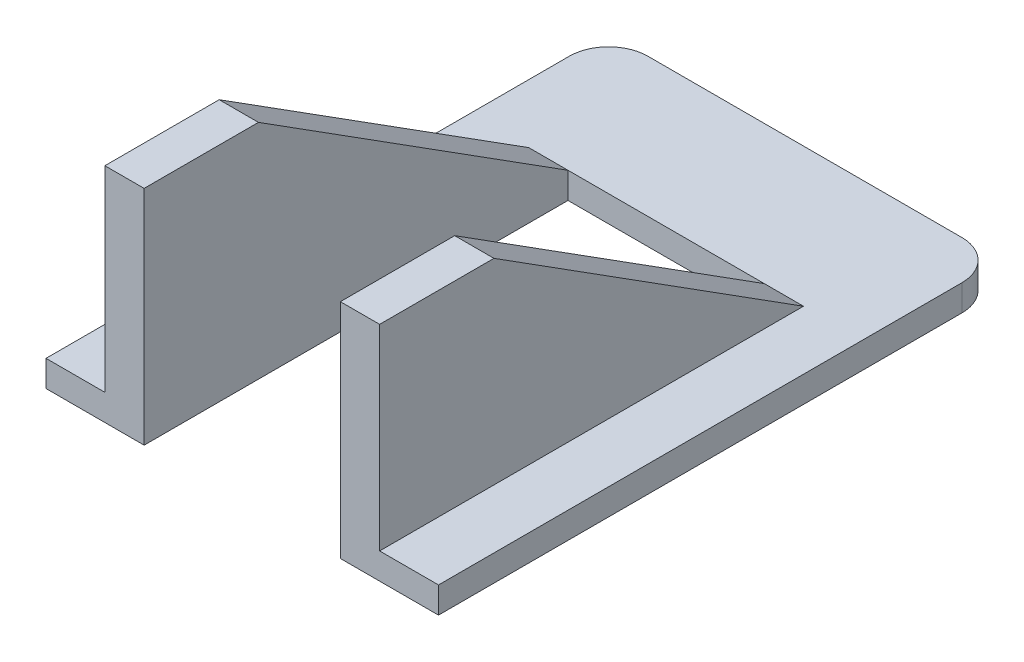
ISO-10303-21;
HEADER;
FILE_DESCRIPTION(('STEP AP214'),'2;1');
FILE_NAME('part.step','',(''),(''),'','','');
FILE_SCHEMA(('AUTOMOTIVE_DESIGN { 1 0 10303 214 1 1 1 1 }'));
ENDSEC;
DATA;
#1=APPLICATION_CONTEXT('core data for automotive mechanical design processes');
#2=APPLICATION_PROTOCOL_DEFINITION('international standard','automotive_design',2000,#1);
#3=PRODUCT_CONTEXT('',#1,'mechanical');
#4=PRODUCT('Part','Part','',(#3));
#5=PRODUCT_RELATED_PRODUCT_CATEGORY('part','',(#4));
#6=PRODUCT_DEFINITION_FORMATION('','',#4);
#7=PRODUCT_DEFINITION_CONTEXT('part definition',#1,'design');
#8=PRODUCT_DEFINITION('design','',#6,#7);
#9=PRODUCT_DEFINITION_SHAPE('','',#8);
#10=(LENGTH_UNIT() NAMED_UNIT(*) SI_UNIT(.MILLI.,.METRE.));
#11=(NAMED_UNIT(*) PLANE_ANGLE_UNIT() SI_UNIT($,.RADIAN.));
#12=(NAMED_UNIT(*) SI_UNIT($,.STERADIAN.) SOLID_ANGLE_UNIT());
#13=UNCERTAINTY_MEASURE_WITH_UNIT(LENGTH_MEASURE(1.E-05),#10,'distance_accuracy_value','');
#14=(GEOMETRIC_REPRESENTATION_CONTEXT(3) GLOBAL_UNCERTAINTY_ASSIGNED_CONTEXT((#13)) GLOBAL_UNIT_ASSIGNED_CONTEXT((#10,
#11,#12)) REPRESENTATION_CONTEXT('',''));
#15=CARTESIAN_POINT('',(0.,0.,0.));
#16=DIRECTION('',(0.,0.,1.));
#17=DIRECTION('',(1.,0.,0.));
#18=AXIS2_PLACEMENT_3D('',#15,#16,#17);
#19=CARTESIAN_POINT('',(30.,1.47718631178707,41.2832699619772));
#20=DIRECTION('',(0.,0.,-1.));
#21=DIRECTION('',(0.,1.,0.));
#22=AXIS2_PLACEMENT_3D('',#19,#20,#21);
#23=PLANE('',#22);
#24=DIRECTION('',(0.,-1.,0.));
#25=VECTOR('',#24,1.);
#26=CARTESIAN_POINT('',(25.5,1.47718631178707,41.2832699619772));
#27=LINE('',#26,#25);
#28=CARTESIAN_POINT('',(25.5,-1.52281368821293,41.2832699619772));
#29=VERTEX_POINT('',#28);
#30=CARTESIAN_POINT('',(25.5,-16.5228136882129,41.2832699619772));
#31=VERTEX_POINT('',#30);
#32=EDGE_CURVE('E166',#29,#31,#27,.T.);
#33=ORIENTED_EDGE('',*,*,#32,.F.);
#34=DIRECTION('',(1.,0.,0.));
#35=VECTOR('',#34,1.);
#36=CARTESIAN_POINT('',(3.,-1.52281368821293,41.2832699619772));
#37=LINE('',#36,#35);
#38=CARTESIAN_POINT('',(22.5,-1.52281368821293,41.2832699619772));
#39=VERTEX_POINT('',#38);
#40=EDGE_CURVE('E148',#39,#29,#37,.T.);
#41=ORIENTED_EDGE('',*,*,#40,.F.);
#42=DIRECTION('',(0.,-1.,0.));
#43=VECTOR('',#42,1.);
#44=CARTESIAN_POINT('',(22.5,-16.5228136882129,41.2832699619772));
#45=LINE('',#44,#43);
#46=CARTESIAN_POINT('',(22.5,-18.5228136882129,41.2832699619772));
#47=VERTEX_POINT('',#46);
#48=EDGE_CURVE('E189',#39,#47,#45,.T.);
#49=ORIENTED_EDGE('',*,*,#48,.T.);
#50=DIRECTION('',(-1.,0.,0.));
#51=VECTOR('',#50,1.);
#52=CARTESIAN_POINT('',(30.,-18.5228136882129,41.2832699619772));
#53=LINE('',#52,#51);
#54=CARTESIAN_POINT('',(30.,-18.5228136882129,41.2832699619772));
#55=VERTEX_POINT('',#54);
#56=EDGE_CURVE('E279',#55,#47,#53,.T.);
#57=ORIENTED_EDGE('',*,*,#56,.F.);
#58=DIRECTION('',(0.,-1.,0.));
#59=VECTOR('',#58,1.);
#60=CARTESIAN_POINT('',(30.,1.47718631178707,41.2832699619772));
#61=LINE('',#60,#59);
#62=CARTESIAN_POINT('',(30.,-16.5228136882129,41.2832699619772));
#63=VERTEX_POINT('',#62);
#64=EDGE_CURVE('E230',#63,#55,#61,.T.);
#65=ORIENTED_EDGE('',*,*,#64,.F.);
#66=DIRECTION('',(1.,0.,0.));
#67=VECTOR('',#66,1.);
#68=CARTESIAN_POINT('',(25.5,-16.5228136882129,41.2832699619772));
#69=LINE('',#68,#67);
#70=EDGE_CURVE('E174',#31,#63,#69,.T.);
#71=ORIENTED_EDGE('',*,*,#70,.F.);
#72=EDGE_LOOP('',(#33,#41,#49,#57,#65,#71));
#73=FACE_BOUND('',#72,.T.);
#74=ADVANCED_FACE('F40',(#73),#23,.F.);
#75=DIRECTION('',(0.,1.,0.));
#76=VECTOR('',#75,1.);
#77=CARTESIAN_POINT('',(7.5,-16.5228136882129,41.2832699619772));
#78=LINE('',#77,#76);
#79=CARTESIAN_POINT('',(7.5,-18.5228136882129,41.2832699619772));
#80=VERTEX_POINT('',#79);
#81=CARTESIAN_POINT('',(7.5,-1.52281368821293,41.2832699619772));
#82=VERTEX_POINT('',#81);
#83=EDGE_CURVE('E198',#80,#82,#78,.T.);
#84=ORIENTED_EDGE('',*,*,#83,.T.);
#85=CARTESIAN_POINT('',(4.5,-1.52281368821293,41.2832699619772));
#86=VERTEX_POINT('',#85);
#87=EDGE_CURVE('E160',#86,#82,#37,.T.);
#88=ORIENTED_EDGE('',*,*,#87,.F.);
#89=DIRECTION('',(0.,1.,0.));
#90=VECTOR('',#89,1.);
#91=CARTESIAN_POINT('',(4.5,-16.5228136882129,41.2832699619772));
#92=LINE('',#91,#90);
#93=CARTESIAN_POINT('',(4.5,-16.5228136882129,41.2832699619772));
#94=VERTEX_POINT('',#93);
#95=EDGE_CURVE('E305',#94,#86,#92,.T.);
#96=ORIENTED_EDGE('',*,*,#95,.F.);
#97=DIRECTION('',(-1.,0.,0.));
#98=VECTOR('',#97,1.);
#99=CARTESIAN_POINT('',(4.5,-16.5228136882129,41.2832699619772));
#100=LINE('',#99,#98);
#101=CARTESIAN_POINT('',(0.,-16.5228136882129,41.2832699619772));
#102=VERTEX_POINT('',#101);
#103=EDGE_CURVE('E177',#94,#102,#100,.T.);
#104=ORIENTED_EDGE('',*,*,#103,.T.);
#105=DIRECTION('',(0.,-1.,0.));
#106=VECTOR('',#105,1.);
#107=CARTESIAN_POINT('',(0.,1.47718631178707,41.2832699619772));
#108=LINE('',#107,#106);
#109=CARTESIAN_POINT('',(0.,-18.5228136882129,41.2832699619772));
#110=VERTEX_POINT('',#109);
#111=EDGE_CURVE('E229',#102,#110,#108,.T.);
#112=ORIENTED_EDGE('',*,*,#111,.T.);
#113=EDGE_CURVE('E282',#80,#110,#53,.T.);
#114=ORIENTED_EDGE('',*,*,#113,.F.);
#115=EDGE_LOOP('',(#84,#88,#96,#104,#112,#114));
#116=FACE_BOUND('',#115,.T.);
#117=ADVANCED_FACE('F319',(#116),#23,.F.);
#118=CARTESIAN_POINT('',(30.,0.,0.));
#119=DIRECTION('',(1.,0.,0.));
#120=DIRECTION('',(0.,0.,-1.));
#121=AXIS2_PLACEMENT_3D('',#118,#119,#120);
#122=PLANE('',#121);
#123=ORIENTED_EDGE('',*,*,#64,.T.);
#124=DIRECTION('',(0.,0.,1.));
#125=VECTOR('',#124,1.);
#126=CARTESIAN_POINT('',(30.,-18.5228136882129,38.2832699619772));
#127=LINE('',#126,#125);
#128=CARTESIAN_POINT('',(30.,-18.5228136882129,1.28326996197718));
#129=VERTEX_POINT('',#128);
#130=EDGE_CURVE('E213',#129,#55,#127,.T.);
#131=ORIENTED_EDGE('',*,*,#130,.F.);
#132=DIRECTION('',(0.,1.,0.));
#133=VECTOR('',#132,1.);
#134=CARTESIAN_POINT('',(30.,-16.5228136882129,1.28326996197718));
#135=LINE('',#134,#133);
#136=CARTESIAN_POINT('',(30.,-16.5228136882129,1.28326996197718));
#137=VERTEX_POINT('',#136);
#138=EDGE_CURVE('E240',#129,#137,#135,.T.);
#139=ORIENTED_EDGE('',*,*,#138,.T.);
#140=DIRECTION('',(0.,0.,-1.));
#141=VECTOR('',#140,1.);
#142=CARTESIAN_POINT('',(30.,-16.5228136882129,3.28326996197718));
#143=LINE('',#142,#141);
#144=EDGE_CURVE('E202',#63,#137,#143,.T.);
#145=ORIENTED_EDGE('',*,*,#144,.F.);
#146=EDGE_LOOP('',(#123,#131,#139,#145));
#147=FACE_BOUND('',#146,.T.);
#148=ADVANCED_FACE('F274',(#147),#122,.T.);
#149=CARTESIAN_POINT('',(0.,0.,0.));
#150=DIRECTION('',(1.,0.,0.));
#151=DIRECTION('',(0.,0.,-1.));
#152=AXIS2_PLACEMENT_3D('',#149,#150,#151);
#153=PLANE('',#152);
#154=DIRECTION('',(0.,0.,1.));
#155=VECTOR('',#154,1.);
#156=CARTESIAN_POINT('',(0.,-18.5228136882129,0.));
#157=LINE('',#156,#155);
#158=CARTESIAN_POINT('',(0.,-18.5228136882129,1.28326996197718));
#159=VERTEX_POINT('',#158);
#160=EDGE_CURVE('E234',#159,#110,#157,.T.);
#161=ORIENTED_EDGE('',*,*,#160,.T.);
#162=ORIENTED_EDGE('',*,*,#111,.F.);
#163=DIRECTION('',(0.,0.,-1.));
#164=VECTOR('',#163,1.);
#165=CARTESIAN_POINT('',(0.,-16.5228136882129,3.28326996197718));
#166=LINE('',#165,#164);
#167=CARTESIAN_POINT('',(0.,-16.5228136882129,1.28326996197718));
#168=VERTEX_POINT('',#167);
#169=EDGE_CURVE('E218',#102,#168,#166,.T.);
#170=ORIENTED_EDGE('',*,*,#169,.T.);
#171=DIRECTION('',(0.,1.,0.));
#172=VECTOR('',#171,1.);
#173=CARTESIAN_POINT('',(0.,0.,1.28326996197719));
#174=LINE('',#173,#172);
#175=EDGE_CURVE('E49',#168,#159,#174,.F.);
#176=ORIENTED_EDGE('',*,*,#175,.T.);
#177=EDGE_LOOP('',(#161,#162,#170,#176));
#178=FACE_BOUND('',#177,.T.);
#179=ADVANCED_FACE('F389',(#178),#153,.F.);
#180=CARTESIAN_POINT('',(22.5,0.,0.));
#181=DIRECTION('',(-1.,0.,0.));
#182=DIRECTION('',(0.,0.,1.));
#183=AXIS2_PLACEMENT_3D('',#180,#181,#182);
#184=PLANE('',#183);
#185=DIRECTION('',(0.,0.,-1.));
#186=VECTOR('',#185,1.);
#187=CARTESIAN_POINT('',(22.5,-18.5228136882129,38.2832699619772));
#188=LINE('',#187,#186);
#189=CARTESIAN_POINT('',(22.5,-18.5228136882129,8.8860830528083));
#190=VERTEX_POINT('',#189);
#191=EDGE_CURVE('E56',#47,#190,#188,.T.);
#192=ORIENTED_EDGE('',*,*,#191,.F.);
#193=ORIENTED_EDGE('',*,*,#48,.F.);
#194=DIRECTION('',(0.,0.,1.));
#195=VECTOR('',#194,1.);
#196=CARTESIAN_POINT('',(22.5,-1.52281368821293,41.2832699619772));
#197=LINE('',#196,#195);
#198=CARTESIAN_POINT('',(22.5,-1.52281368821293,32.5459195541393));
#199=VERTEX_POINT('',#198);
#200=EDGE_CURVE('E155',#199,#39,#197,.T.);
#201=ORIENTED_EDGE('',*,*,#200,.F.);
#202=DIRECTION('',(0.,0.535445311375715,0.844569901503578));
#203=VECTOR('',#202,1.);
#204=CARTESIAN_POINT('',(22.5,-1.52281368821293,32.5459195541393));
#205=LINE('',#204,#203);
#206=CARTESIAN_POINT('',(22.5,-16.5228136882129,8.8860830528083));
#207=VERTEX_POINT('',#206);
#208=EDGE_CURVE('E205',#207,#199,#205,.T.);
#209=ORIENTED_EDGE('',*,*,#208,.F.);
#210=DIRECTION('',(0.,1.,0.));
#211=VECTOR('',#210,1.);
#212=CARTESIAN_POINT('',(22.5,-21.0228136882129,8.8860830528083));
#213=LINE('',#212,#211);
#214=EDGE_CURVE('E287',#190,#207,#213,.T.);
#215=ORIENTED_EDGE('',*,*,#214,.F.);
#216=EDGE_LOOP('',(#192,#193,#201,#209,#215));
#217=FACE_BOUND('',#216,.T.);
#218=ADVANCED_FACE('F338',(#217),#184,.T.);
#219=CARTESIAN_POINT('',(7.5,0.,0.));
#220=DIRECTION('',(1.,0.,0.));
#221=DIRECTION('',(0.,0.,-1.));
#222=AXIS2_PLACEMENT_3D('',#219,#220,#221);
#223=PLANE('',#222);
#224=ORIENTED_EDGE('',*,*,#83,.F.);
#225=DIRECTION('',(0.,0.,1.));
#226=VECTOR('',#225,1.);
#227=CARTESIAN_POINT('',(7.5,-18.5228136882129,38.2832699619772));
#228=LINE('',#227,#226);
#229=CARTESIAN_POINT('',(7.5,-18.5228136882129,8.8860830528083));
#230=VERTEX_POINT('',#229);
#231=EDGE_CURVE('E295',#230,#80,#228,.T.);
#232=ORIENTED_EDGE('',*,*,#231,.F.);
#233=DIRECTION('',(0.,1.,0.));
#234=VECTOR('',#233,1.);
#235=CARTESIAN_POINT('',(7.5,-21.0228136882129,8.8860830528083));
#236=LINE('',#235,#234);
#237=CARTESIAN_POINT('',(7.5,-16.5228136882129,8.8860830528083));
#238=VERTEX_POINT('',#237);
#239=EDGE_CURVE('E281',#230,#238,#236,.T.);
#240=ORIENTED_EDGE('',*,*,#239,.T.);
#241=DIRECTION('',(0.,-0.535445311375715,-0.844569901503578));
#242=VECTOR('',#241,1.);
#243=CARTESIAN_POINT('',(7.5,-1.52281368821293,32.5459195541393));
#244=LINE('',#243,#242);
#245=CARTESIAN_POINT('',(7.5,-1.52281368821293,32.5459195541393));
#246=VERTEX_POINT('',#245);
#247=EDGE_CURVE('E190',#246,#238,#244,.T.);
#248=ORIENTED_EDGE('',*,*,#247,.F.);
#249=DIRECTION('',(0.,0.,-1.));
#250=VECTOR('',#249,1.);
#251=CARTESIAN_POINT('',(7.5,-1.52281368821293,41.2832699619772));
#252=LINE('',#251,#250);
#253=EDGE_CURVE('E194',#82,#246,#252,.T.);
#254=ORIENTED_EDGE('',*,*,#253,.F.);
#255=EDGE_LOOP('',(#224,#232,#240,#248,#254));
#256=FACE_BOUND('',#255,.T.);
#257=ADVANCED_FACE('F345',(#256),#223,.T.);
#258=CARTESIAN_POINT('',(30.,1.47718631178707,-1.71673003802281));
#259=DIRECTION('',(0.,0.,1.));
#260=DIRECTION('',(0.,-1.,0.));
#261=AXIS2_PLACEMENT_3D('',#258,#259,#260);
#262=PLANE('',#261);
#263=DIRECTION('',(1.,0.,0.));
#264=VECTOR('',#263,1.);
#265=CARTESIAN_POINT('',(0.,-16.5228136882129,-1.71673003802282));
#266=LINE('',#265,#264);
#267=CARTESIAN_POINT('',(3.,-16.5228136882129,-1.71673003802282));
#268=VERTEX_POINT('',#267);
#269=CARTESIAN_POINT('',(27.,-16.5228136882129,-1.71673003802282));
#270=VERTEX_POINT('',#269);
#271=EDGE_CURVE('E217',#268,#270,#266,.T.);
#272=ORIENTED_EDGE('',*,*,#271,.T.);
#273=DIRECTION('',(0.,1.,0.));
#274=VECTOR('',#273,1.);
#275=CARTESIAN_POINT('',(27.,-18.5228136882129,-1.71673003802282));
#276=LINE('',#275,#274);
#277=CARTESIAN_POINT('',(27.,-18.5228136882129,-1.71673003802282));
#278=VERTEX_POINT('',#277);
#279=EDGE_CURVE('E255',#270,#278,#276,.F.);
#280=ORIENTED_EDGE('',*,*,#279,.T.);
#281=DIRECTION('',(-1.,0.,0.));
#282=VECTOR('',#281,1.);
#283=CARTESIAN_POINT('',(30.,-18.5228136882129,-1.71673003802282));
#284=LINE('',#283,#282);
#285=CARTESIAN_POINT('',(3.,-18.5228136882129,-1.71673003802282));
#286=VERTEX_POINT('',#285);
#287=EDGE_CURVE('E216',#278,#286,#284,.T.);
#288=ORIENTED_EDGE('',*,*,#287,.T.);
#289=DIRECTION('',(0.,1.,0.));
#290=VECTOR('',#289,1.);
#291=CARTESIAN_POINT('',(3.,1.47718631178707,-1.71673003802281));
#292=LINE('',#291,#290);
#293=EDGE_CURVE('E251',#286,#268,#292,.T.);
#294=ORIENTED_EDGE('',*,*,#293,.T.);
#295=EDGE_LOOP('',(#272,#280,#288,#294));
#296=FACE_BOUND('',#295,.T.);
#297=ADVANCED_FACE('F369',(#296),#262,.F.);
#298=CARTESIAN_POINT('',(0.,-16.5228136882129,3.28326996197718));
#299=DIRECTION('',(0.,-1.,0.));
#300=DIRECTION('',(0.,0.,-1.));
#301=AXIS2_PLACEMENT_3D('',#298,#299,#300);
#302=PLANE('',#301);
#303=CARTESIAN_POINT('',(27.,-16.5228136882129,1.28326996197718));
#304=DIRECTION('',(0.,-1.,0.));
#305=DIRECTION('',(0.,0.,-1.));
#306=AXIS2_PLACEMENT_3D('',#303,#304,#305);
#307=CIRCLE('',#306,3.);
#308=EDGE_CURVE('E247',#137,#270,#307,.F.);
#309=ORIENTED_EDGE('',*,*,#308,.T.);
#310=ORIENTED_EDGE('',*,*,#271,.F.);
#311=CARTESIAN_POINT('',(3.,-16.5228136882129,1.28326996197718));
#312=DIRECTION('',(0.,-1.,0.));
#313=DIRECTION('',(0.,0.,-1.));
#314=AXIS2_PLACEMENT_3D('',#311,#312,#313);
#315=CIRCLE('',#314,3.);
#316=EDGE_CURVE('E244',#268,#168,#315,.F.);
#317=ORIENTED_EDGE('',*,*,#316,.T.);
#318=ORIENTED_EDGE('',*,*,#169,.F.);
#319=ORIENTED_EDGE('',*,*,#103,.F.);
#320=DIRECTION('',(0.,0.,1.));
#321=VECTOR('',#320,1.);
#322=CARTESIAN_POINT('',(4.5,-16.5228136882129,3.28326996197718));
#323=LINE('',#322,#321);
#324=CARTESIAN_POINT('',(4.5,-16.5228136882129,8.8860830528083));
#325=VERTEX_POINT('',#324);
#326=EDGE_CURVE('E183',#325,#94,#323,.T.);
#327=ORIENTED_EDGE('',*,*,#326,.F.);
#328=DIRECTION('',(1.,0.,0.));
#329=VECTOR('',#328,1.);
#330=CARTESIAN_POINT('',(3.,-16.5228136882129,8.8860830528083));
#331=LINE('',#330,#329);
#332=EDGE_CURVE('E333',#325,#238,#331,.T.);
#333=ORIENTED_EDGE('',*,*,#332,.T.);
#334=DIRECTION('',(1.,0.,0.));
#335=VECTOR('',#334,1.);
#336=CARTESIAN_POINT('',(-35.7012285450742,-16.5228136882129,8.8860830528083));
#337=LINE('',#336,#335);
#338=EDGE_CURVE('E195',#238,#207,#337,.T.);
#339=ORIENTED_EDGE('',*,*,#338,.T.);
#340=CARTESIAN_POINT('',(25.5,-16.5228136882129,8.8860830528083));
#341=VERTEX_POINT('',#340);
#342=EDGE_CURVE('E330',#207,#341,#331,.T.);
#343=ORIENTED_EDGE('',*,*,#342,.T.);
#344=DIRECTION('',(0.,0.,-1.));
#345=VECTOR('',#344,1.);
#346=CARTESIAN_POINT('',(25.5,-16.5228136882129,3.28326996197718));
#347=LINE('',#346,#345);
#348=EDGE_CURVE('E176',#31,#341,#347,.T.);
#349=ORIENTED_EDGE('',*,*,#348,.F.);
#350=ORIENTED_EDGE('',*,*,#70,.T.);
#351=ORIENTED_EDGE('',*,*,#144,.T.);
#352=EDGE_LOOP('',(#309,#310,#317,#318,#319,#327,#333,#339,#343,#349,#350,#351));
#353=FACE_BOUND('',#352,.T.);
#354=ADVANCED_FACE('F278',(#353),#302,.F.);
#355=CARTESIAN_POINT('',(0.,-18.5228136882129,38.2832699619772));
#356=DIRECTION('',(0.,1.,0.));
#357=DIRECTION('',(0.,0.,1.));
#358=AXIS2_PLACEMENT_3D('',#355,#356,#357);
#359=PLANE('',#358);
#360=ORIENTED_EDGE('',*,*,#191,.T.);
#361=DIRECTION('',(-1.,0.,0.));
#362=VECTOR('',#361,1.);
#363=CARTESIAN_POINT('',(0.,-18.5228136882129,8.8860830528083));
#364=LINE('',#363,#362);
#365=EDGE_CURVE('E301',#190,#230,#364,.T.);
#366=ORIENTED_EDGE('',*,*,#365,.T.);
#367=ORIENTED_EDGE('',*,*,#231,.T.);
#368=ORIENTED_EDGE('',*,*,#113,.T.);
#369=ORIENTED_EDGE('',*,*,#160,.F.);
#370=CARTESIAN_POINT('',(3.,-18.5228136882129,1.28326996197718));
#371=DIRECTION('',(0.,1.,0.));
#372=DIRECTION('',(0.,0.,1.));
#373=AXIS2_PLACEMENT_3D('',#370,#371,#372);
#374=CIRCLE('',#373,3.);
#375=EDGE_CURVE('E258',#159,#286,#374,.F.);
#376=ORIENTED_EDGE('',*,*,#375,.T.);
#377=ORIENTED_EDGE('',*,*,#287,.F.);
#378=CARTESIAN_POINT('',(27.,-18.5228136882129,1.28326996197718));
#379=DIRECTION('',(0.,1.,0.));
#380=DIRECTION('',(0.,0.,1.));
#381=AXIS2_PLACEMENT_3D('',#378,#379,#380);
#382=CIRCLE('',#381,3.);
#383=EDGE_CURVE('E261',#278,#129,#382,.F.);
#384=ORIENTED_EDGE('',*,*,#383,.T.);
#385=ORIENTED_EDGE('',*,*,#130,.T.);
#386=ORIENTED_EDGE('',*,*,#56,.T.);
#387=EDGE_LOOP('',(#360,#366,#367,#368,#369,#376,#377,#384,#385,#386));
#388=FACE_BOUND('',#387,.T.);
#389=ADVANCED_FACE('F268',(#388),#359,.F.);
#390=CARTESIAN_POINT('',(25.5,0.,0.));
#391=DIRECTION('',(-1.,0.,0.));
#392=DIRECTION('',(0.,0.,1.));
#393=AXIS2_PLACEMENT_3D('',#390,#391,#392);
#394=PLANE('',#393);
#395=ORIENTED_EDGE('',*,*,#348,.T.);
#396=DIRECTION('',(0.,-0.535445311375715,-0.844569901503578));
#397=VECTOR('',#396,1.);
#398=CARTESIAN_POINT('',(25.5,-1.52281368821293,32.5459195541393));
#399=LINE('',#398,#397);
#400=CARTESIAN_POINT('',(25.5,-1.52281368821293,32.5459195541393));
#401=VERTEX_POINT('',#400);
#402=EDGE_CURVE('E161',#401,#341,#399,.T.);
#403=ORIENTED_EDGE('',*,*,#402,.F.);
#404=DIRECTION('',(0.,0.,-1.));
#405=VECTOR('',#404,1.);
#406=CARTESIAN_POINT('',(25.5,-1.52281368821293,41.2832699619772));
#407=LINE('',#406,#405);
#408=EDGE_CURVE('E152',#29,#401,#407,.T.);
#409=ORIENTED_EDGE('',*,*,#408,.F.);
#410=ORIENTED_EDGE('',*,*,#32,.T.);
#411=EDGE_LOOP('',(#395,#403,#409,#410));
#412=FACE_BOUND('',#411,.T.);
#413=ADVANCED_FACE('F165',(#412),#394,.F.);
#414=CARTESIAN_POINT('',(4.5,0.,0.));
#415=DIRECTION('',(-1.,0.,0.));
#416=DIRECTION('',(0.,0.,1.));
#417=AXIS2_PLACEMENT_3D('',#414,#415,#416);
#418=PLANE('',#417);
#419=DIRECTION('',(0.,0.535445311375715,0.844569901503578));
#420=VECTOR('',#419,1.);
#421=CARTESIAN_POINT('',(4.5,-15.8041685310392,10.0196181808886));
#422=LINE('',#421,#420);
#423=CARTESIAN_POINT('',(4.5,-1.52281368821293,32.5459195541393));
#424=VERTEX_POINT('',#423);
#425=EDGE_CURVE('E290',#325,#424,#422,.T.);
#426=ORIENTED_EDGE('',*,*,#425,.F.);
#427=ORIENTED_EDGE('',*,*,#326,.T.);
#428=ORIENTED_EDGE('',*,*,#95,.T.);
#429=DIRECTION('',(0.,0.,1.));
#430=VECTOR('',#429,1.);
#431=CARTESIAN_POINT('',(4.5,-1.52281368821293,0.));
#432=LINE('',#431,#430);
#433=EDGE_CURVE('E12',#424,#86,#432,.T.);
#434=ORIENTED_EDGE('',*,*,#433,.F.);
#435=EDGE_LOOP('',(#426,#427,#428,#434));
#436=FACE_BOUND('',#435,.T.);
#437=ADVANCED_FACE('F313',(#436),#418,.T.);
#438=CARTESIAN_POINT('',(27.,0.,1.28326996197719));
#439=DIRECTION('',(0.,-1.,0.));
#440=DIRECTION('',(0.,0.,-1.));
#441=AXIS2_PLACEMENT_3D('',#438,#439,#440);
#442=CYLINDRICAL_SURFACE('',#441,3.);
#443=ORIENTED_EDGE('',*,*,#383,.F.);
#444=ORIENTED_EDGE('',*,*,#279,.F.);
#445=ORIENTED_EDGE('',*,*,#308,.F.);
#446=ORIENTED_EDGE('',*,*,#138,.F.);
#447=EDGE_LOOP('',(#443,#444,#445,#446));
#448=FACE_BOUND('',#447,.T.);
#449=ADVANCED_FACE('F275',(#448),#442,.T.);
#450=CARTESIAN_POINT('',(3.,1.47718631178707,1.28326996197719));
#451=DIRECTION('',(0.,1.,0.));
#452=DIRECTION('',(0.,0.,1.));
#453=AXIS2_PLACEMENT_3D('',#450,#451,#452);
#454=CYLINDRICAL_SURFACE('',#453,3.);
#455=ORIENTED_EDGE('',*,*,#375,.F.);
#456=ORIENTED_EDGE('',*,*,#175,.F.);
#457=ORIENTED_EDGE('',*,*,#316,.F.);
#458=ORIENTED_EDGE('',*,*,#293,.F.);
#459=EDGE_LOOP('',(#455,#456,#457,#458));
#460=FACE_BOUND('',#459,.T.);
#461=ADVANCED_FACE('F42',(#460),#454,.T.);
#462=CARTESIAN_POINT('',(22.5,-21.0228136882129,8.8860830528083));
#463=DIRECTION('',(0.,0.,-1.));
#464=DIRECTION('',(0.,1.,0.));
#465=AXIS2_PLACEMENT_3D('',#462,#463,#464);
#466=PLANE('',#465);
#467=ORIENTED_EDGE('',*,*,#214,.T.);
#468=ORIENTED_EDGE('',*,*,#338,.F.);
#469=ORIENTED_EDGE('',*,*,#239,.F.);
#470=ORIENTED_EDGE('',*,*,#365,.F.);
#471=EDGE_LOOP('',(#467,#468,#469,#470));
#472=FACE_BOUND('',#471,.T.);
#473=ADVANCED_FACE('F342',(#472),#466,.F.);
#474=CARTESIAN_POINT('',(3.,-1.52281368821293,41.2832699619772));
#475=DIRECTION('',(0.,-1.,0.));
#476=DIRECTION('',(0.,0.,-1.));
#477=AXIS2_PLACEMENT_3D('',#474,#475,#476);
#478=PLANE('',#477);
#479=ORIENTED_EDGE('',*,*,#200,.T.);
#480=ORIENTED_EDGE('',*,*,#40,.T.);
#481=ORIENTED_EDGE('',*,*,#408,.T.);
#482=DIRECTION('',(1.,0.,0.));
#483=VECTOR('',#482,1.);
#484=CARTESIAN_POINT('',(3.,-1.52281368821293,32.5459195541393));
#485=LINE('',#484,#483);
#486=EDGE_CURVE('E325',#199,#401,#485,.T.);
#487=ORIENTED_EDGE('',*,*,#486,.F.);
#488=EDGE_LOOP('',(#479,#480,#481,#487));
#489=FACE_BOUND('',#488,.T.);
#490=ADVANCED_FACE('F150',(#489),#478,.F.);
#491=CARTESIAN_POINT('',(3.,-1.52281368821293,32.5459195541393));
#492=DIRECTION('',(0.,-0.844569901503578,0.535445311375715));
#493=DIRECTION('',(0.,-0.535445311375715,-0.844569901503578));
#494=AXIS2_PLACEMENT_3D('',#491,#492,#493);
#495=PLANE('',#494);
#496=ORIENTED_EDGE('',*,*,#208,.T.);
#497=ORIENTED_EDGE('',*,*,#486,.T.);
#498=ORIENTED_EDGE('',*,*,#402,.T.);
#499=ORIENTED_EDGE('',*,*,#342,.F.);
#500=EDGE_LOOP('',(#496,#497,#498,#499));
#501=FACE_BOUND('',#500,.T.);
#502=ADVANCED_FACE('F336',(#501),#495,.F.);
#503=ORIENTED_EDGE('',*,*,#247,.T.);
#504=ORIENTED_EDGE('',*,*,#332,.F.);
#505=ORIENTED_EDGE('',*,*,#425,.T.);
#506=EDGE_CURVE('E327',#424,#246,#485,.T.);
#507=ORIENTED_EDGE('',*,*,#506,.T.);
#508=EDGE_LOOP('',(#503,#504,#505,#507));
#509=FACE_BOUND('',#508,.T.);
#510=ADVANCED_FACE('F351',(#509),#495,.F.);
#511=ORIENTED_EDGE('',*,*,#253,.T.);
#512=ORIENTED_EDGE('',*,*,#506,.F.);
#513=ORIENTED_EDGE('',*,*,#433,.T.);
#514=ORIENTED_EDGE('',*,*,#87,.T.);
#515=EDGE_LOOP('',(#511,#512,#513,#514));
#516=FACE_BOUND('',#515,.T.);
#517=ADVANCED_FACE('F349',(#516),#478,.F.);
#518=CLOSED_SHELL('',(#74,#117,#148,#179,#218,#257,#297,#354,#389,#413,#437,#449,#461,#473,#490,
#502,#510,#517));
#519=MANIFOLD_SOLID_BREP('B2',#518);
#520=ADVANCED_BREP_SHAPE_REPRESENTATION('',(#18,#519),#14);
#521=SHAPE_DEFINITION_REPRESENTATION(#9,#520);
ENDSEC;
END-ISO-10303-21;
